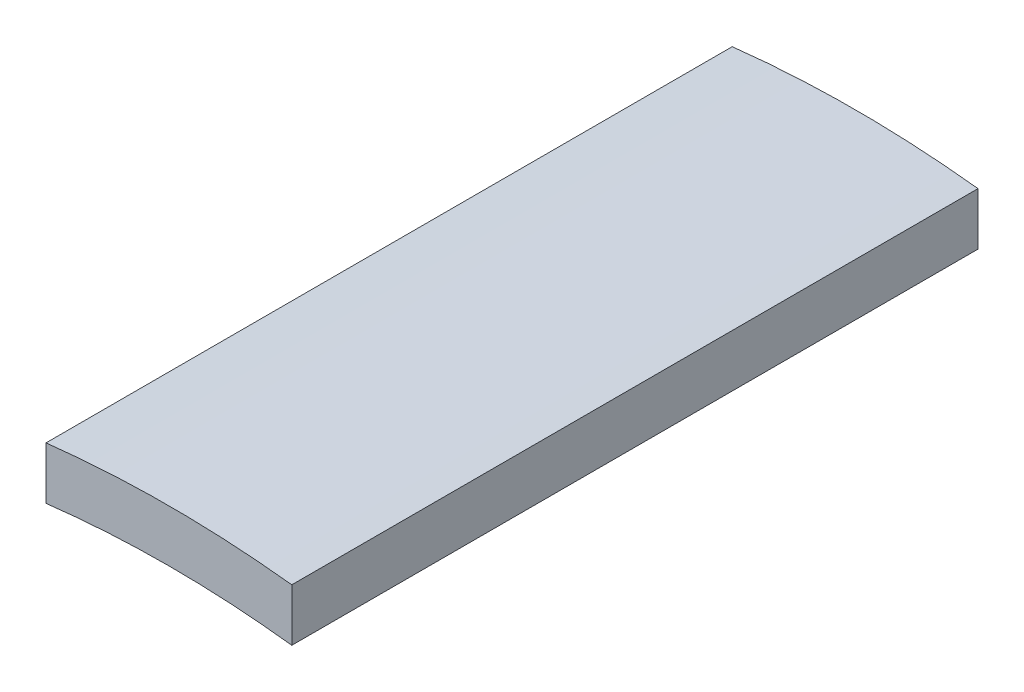
ISO-10303-21;
HEADER;
FILE_DESCRIPTION(('STEP AP214'),'2;1');
FILE_NAME('part.step','',(''),(''),'','','');
FILE_SCHEMA(('AUTOMOTIVE_DESIGN { 1 0 10303 214 1 1 1 1 }'));
ENDSEC;
DATA;
#1=APPLICATION_CONTEXT('core data for automotive mechanical design processes');
#2=APPLICATION_PROTOCOL_DEFINITION('international standard','automotive_design',2000,#1);
#3=PRODUCT_CONTEXT('',#1,'mechanical');
#4=PRODUCT('Part','Part','',(#3));
#5=PRODUCT_RELATED_PRODUCT_CATEGORY('part','',(#4));
#6=PRODUCT_DEFINITION_FORMATION('','',#4);
#7=PRODUCT_DEFINITION_CONTEXT('part definition',#1,'design');
#8=PRODUCT_DEFINITION('design','',#6,#7);
#9=PRODUCT_DEFINITION_SHAPE('','',#8);
#10=(LENGTH_UNIT() NAMED_UNIT(*) SI_UNIT(.MILLI.,.METRE.));
#11=(NAMED_UNIT(*) PLANE_ANGLE_UNIT() SI_UNIT($,.RADIAN.));
#12=(NAMED_UNIT(*) SI_UNIT($,.STERADIAN.) SOLID_ANGLE_UNIT());
#13=UNCERTAINTY_MEASURE_WITH_UNIT(LENGTH_MEASURE(1.E-05),#10,'distance_accuracy_value','');
#14=(GEOMETRIC_REPRESENTATION_CONTEXT(3) GLOBAL_UNCERTAINTY_ASSIGNED_CONTEXT((#13)) GLOBAL_UNIT_ASSIGNED_CONTEXT((#10,
#11,#12)) REPRESENTATION_CONTEXT('',''));
#15=CARTESIAN_POINT('',(0.,0.,0.));
#16=DIRECTION('',(0.,0.,1.));
#17=DIRECTION('',(1.,0.,0.));
#18=AXIS2_PLACEMENT_3D('',#15,#16,#17);
#19=CARTESIAN_POINT('',(-110.435261655171,-75.8999546142995,6.56206354763538));
#20=DIRECTION('',(0.,0.,1.));
#21=DIRECTION('',(1.,0.,0.));
#22=AXIS2_PLACEMENT_3D('',#19,#20,#21);
#23=CYLINDRICAL_SURFACE('',#22,2.50000000000002);
#24=DIRECTION('',(0.,0.,1.));
#25=VECTOR('',#24,1.);
#26=CARTESIAN_POINT('',(-110.152003047214,-73.4160535371593,5.48543056897768));
#27=LINE('',#26,#25);
#28=CARTESIAN_POINT('',(-110.152003047214,-73.4160535371593,5.48543056897768));
#29=VERTEX_POINT('',#28);
#30=CARTESIAN_POINT('',(-110.152003047214,-73.4160535371593,3.9039033412182));
#31=VERTEX_POINT('',#30);
#32=EDGE_CURVE('E58',#29,#31,#27,.F.);
#33=ORIENTED_EDGE('',*,*,#32,.T.);
#34=CARTESIAN_POINT('',(-110.435261655171,-75.8999546142995,3.9039033412182));
#35=DIRECTION('',(0.,0.,1.));
#36=DIRECTION('',(1.,0.,0.));
#37=AXIS2_PLACEMENT_3D('',#34,#35,#36);
#38=CIRCLE('',#37,2.50000000000002);
#39=CARTESIAN_POINT('',(-110.718520263128,-73.4160535371593,3.9039033412182));
#40=VERTEX_POINT('',#39);
#41=EDGE_CURVE('E67',#31,#40,#38,.T.);
#42=ORIENTED_EDGE('',*,*,#41,.T.);
#43=DIRECTION('',(0.,0.,-1.));
#44=VECTOR('',#43,1.);
#45=CARTESIAN_POINT('',(-110.718520263128,-73.4160535371594,3.9039033412182));
#46=LINE('',#45,#44);
#47=CARTESIAN_POINT('',(-110.718520263128,-73.4160535371593,5.48543056897768));
#48=VERTEX_POINT('',#47);
#49=EDGE_CURVE('E60',#40,#48,#46,.F.);
#50=ORIENTED_EDGE('',*,*,#49,.T.);
#51=CARTESIAN_POINT('',(-110.435261655171,-75.8999546142995,5.48543056897768));
#52=DIRECTION('',(0.,0.,1.));
#53=DIRECTION('',(1.,0.,0.));
#54=AXIS2_PLACEMENT_3D('',#51,#52,#53);
#55=CIRCLE('',#54,2.50000000000002);
#56=EDGE_CURVE('E20',#48,#29,#55,.F.);
#57=ORIENTED_EDGE('',*,*,#56,.T.);
#58=EDGE_LOOP('',(#33,#42,#50,#57));
#59=FACE_BOUND('',#58,.T.);
#60=ADVANCED_FACE('F17',(#59),#23,.T.);
#61=CARTESIAN_POINT('',(-110.152003047214,-76.3010935552146,5.48543056897768));
#62=DIRECTION('',(-1.,0.,0.));
#63=DIRECTION('',(0.,0.,1.));
#64=AXIS2_PLACEMENT_3D('',#61,#62,#63);
#65=PLANE('',#64);
#66=DIRECTION('',(0.,0.,1.));
#67=VECTOR('',#66,1.);
#68=CARTESIAN_POINT('',(-110.152003047214,-73.5368709168782,6.56206354763538));
#69=LINE('',#68,#67);
#70=CARTESIAN_POINT('',(-110.152003047214,-73.5368709168782,5.48543056897768));
#71=VERTEX_POINT('',#70);
#72=CARTESIAN_POINT('',(-110.152003047214,-73.5368709168782,3.9039033412182));
#73=VERTEX_POINT('',#72);
#74=EDGE_CURVE('E72',#71,#73,#69,.F.);
#75=ORIENTED_EDGE('',*,*,#74,.T.);
#76=DIRECTION('',(0.,1.,0.));
#77=VECTOR('',#76,1.);
#78=CARTESIAN_POINT('',(-110.152003047214,-76.3010935552146,3.9039033412182));
#79=LINE('',#78,#77);
#80=EDGE_CURVE('E66',#73,#31,#79,.T.);
#81=ORIENTED_EDGE('',*,*,#80,.T.);
#82=ORIENTED_EDGE('',*,*,#32,.F.);
#83=DIRECTION('',(0.,1.,0.));
#84=VECTOR('',#83,1.);
#85=CARTESIAN_POINT('',(-110.152003047214,-76.3010935552146,5.48543056897768));
#86=LINE('',#85,#84);
#87=EDGE_CURVE('E65',#29,#71,#86,.F.);
#88=ORIENTED_EDGE('',*,*,#87,.T.);
#89=EDGE_LOOP('',(#75,#81,#82,#88));
#90=FACE_BOUND('',#89,.T.);
#91=ADVANCED_FACE('F64',(#90),#65,.F.);
#92=CARTESIAN_POINT('',(-110.152003047214,-76.3010935552146,3.9039033412182));
#93=DIRECTION('',(0.,0.,1.));
#94=DIRECTION('',(1.,0.,0.));
#95=AXIS2_PLACEMENT_3D('',#92,#93,#94);
#96=PLANE('',#95);
#97=CARTESIAN_POINT('',(-110.435261655171,-75.8999546142995,3.9039033412182));
#98=DIRECTION('',(0.,0.,1.));
#99=DIRECTION('',(1.,0.,0.));
#100=AXIS2_PLACEMENT_3D('',#97,#98,#99);
#101=CIRCLE('',#100,2.38000000000001);
#102=CARTESIAN_POINT('',(-110.718520263128,-73.5368709168782,3.9039033412182));
#103=VERTEX_POINT('',#102);
#104=EDGE_CURVE('E79',#73,#103,#101,.T.);
#105=ORIENTED_EDGE('',*,*,#104,.T.);
#106=DIRECTION('',(0.,1.,0.));
#107=VECTOR('',#106,1.);
#108=CARTESIAN_POINT('',(-110.718520263128,-76.3010935552146,3.9039033412182));
#109=LINE('',#108,#107);
#110=EDGE_CURVE('E70',#103,#40,#109,.T.);
#111=ORIENTED_EDGE('',*,*,#110,.T.);
#112=ORIENTED_EDGE('',*,*,#41,.F.);
#113=ORIENTED_EDGE('',*,*,#80,.F.);
#114=EDGE_LOOP('',(#105,#111,#112,#113));
#115=FACE_BOUND('',#114,.T.);
#116=ADVANCED_FACE('F85',(#115),#96,.F.);
#117=CARTESIAN_POINT('',(-110.718520263128,-76.3010935552146,3.9039033412182));
#118=DIRECTION('',(1.,0.,0.));
#119=DIRECTION('',(0.,0.,-1.));
#120=AXIS2_PLACEMENT_3D('',#117,#118,#119);
#121=PLANE('',#120);
#122=DIRECTION('',(0.,0.,1.));
#123=VECTOR('',#122,1.);
#124=CARTESIAN_POINT('',(-110.718520263128,-73.5368709168782,6.56206354763538));
#125=LINE('',#124,#123);
#126=CARTESIAN_POINT('',(-110.718520263128,-73.5368709168782,5.48543056897768));
#127=VERTEX_POINT('',#126);
#128=EDGE_CURVE('E26',#103,#127,#125,.T.);
#129=ORIENTED_EDGE('',*,*,#128,.T.);
#130=DIRECTION('',(0.,1.,0.));
#131=VECTOR('',#130,1.);
#132=CARTESIAN_POINT('',(-110.718520263128,-76.3010935552146,5.48543056897768));
#133=LINE('',#132,#131);
#134=EDGE_CURVE('E34',#127,#48,#133,.T.);
#135=ORIENTED_EDGE('',*,*,#134,.T.);
#136=ORIENTED_EDGE('',*,*,#49,.F.);
#137=ORIENTED_EDGE('',*,*,#110,.F.);
#138=EDGE_LOOP('',(#129,#135,#136,#137));
#139=FACE_BOUND('',#138,.T.);
#140=ADVANCED_FACE('F89',(#139),#121,.F.);
#141=CARTESIAN_POINT('',(-110.718520263128,-76.3010935552146,5.48543056897768));
#142=DIRECTION('',(0.,0.,-1.));
#143=DIRECTION('',(-1.,0.,0.));
#144=AXIS2_PLACEMENT_3D('',#141,#142,#143);
#145=PLANE('',#144);
#146=CARTESIAN_POINT('',(-110.435261655171,-75.8999546142995,5.48543056897768));
#147=DIRECTION('',(0.,0.,1.));
#148=DIRECTION('',(1.,0.,0.));
#149=AXIS2_PLACEMENT_3D('',#146,#147,#148);
#150=CIRCLE('',#149,2.38000000000001);
#151=EDGE_CURVE('E11',#127,#71,#150,.F.);
#152=ORIENTED_EDGE('',*,*,#151,.T.);
#153=ORIENTED_EDGE('',*,*,#87,.F.);
#154=ORIENTED_EDGE('',*,*,#56,.F.);
#155=ORIENTED_EDGE('',*,*,#134,.F.);
#156=EDGE_LOOP('',(#152,#153,#154,#155));
#157=FACE_BOUND('',#156,.T.);
#158=ADVANCED_FACE('F69',(#157),#145,.F.);
#159=CARTESIAN_POINT('',(-110.435261655171,-75.8999546142995,6.56206354763538));
#160=DIRECTION('',(0.,0.,1.));
#161=DIRECTION('',(1.,0.,0.));
#162=AXIS2_PLACEMENT_3D('',#159,#160,#161);
#163=CYLINDRICAL_SURFACE('',#162,2.38000000000001);
#164=ORIENTED_EDGE('',*,*,#128,.F.);
#165=ORIENTED_EDGE('',*,*,#104,.F.);
#166=ORIENTED_EDGE('',*,*,#74,.F.);
#167=ORIENTED_EDGE('',*,*,#151,.F.);
#168=EDGE_LOOP('',(#164,#165,#166,#167));
#169=FACE_BOUND('',#168,.T.);
#170=ADVANCED_FACE('F91',(#169),#163,.F.);
#171=CLOSED_SHELL('',(#60,#91,#116,#140,#158,#170));
#172=MANIFOLD_SOLID_BREP('B1',#171);
#173=ADVANCED_BREP_SHAPE_REPRESENTATION('',(#18,#172),#14);
#174=SHAPE_DEFINITION_REPRESENTATION(#9,#173);
ENDSEC;
END-ISO-10303-21;
